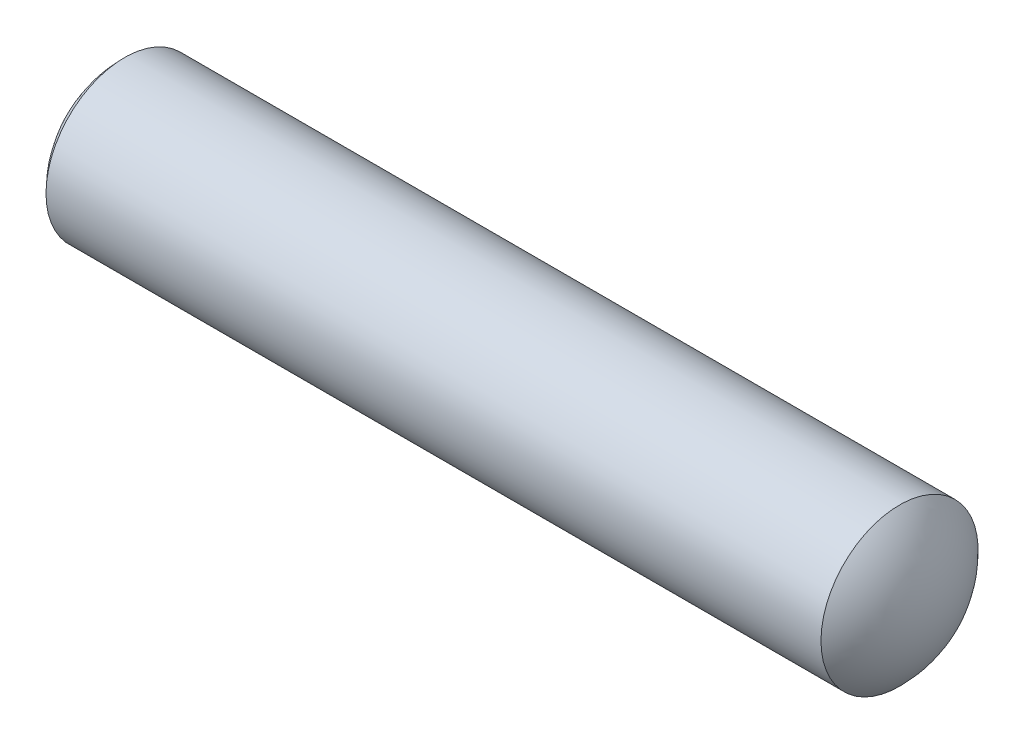
ISO-10303-21;
HEADER;
FILE_DESCRIPTION(('STEP AP214'),'2;1');
FILE_NAME('part.step','',(''),(''),'','','');
FILE_SCHEMA(('AUTOMOTIVE_DESIGN { 1 0 10303 214 1 1 1 1 }'));
ENDSEC;
DATA;
#1=APPLICATION_CONTEXT('core data for automotive mechanical design processes');
#2=APPLICATION_PROTOCOL_DEFINITION('international standard','automotive_design',2000,#1);
#3=PRODUCT_CONTEXT('',#1,'mechanical');
#4=PRODUCT('Part','Part','',(#3));
#5=PRODUCT_RELATED_PRODUCT_CATEGORY('part','',(#4));
#6=PRODUCT_DEFINITION_FORMATION('','',#4);
#7=PRODUCT_DEFINITION_CONTEXT('part definition',#1,'design');
#8=PRODUCT_DEFINITION('design','',#6,#7);
#9=PRODUCT_DEFINITION_SHAPE('','',#8);
#10=(LENGTH_UNIT() NAMED_UNIT(*) SI_UNIT(.MILLI.,.METRE.));
#11=(NAMED_UNIT(*) PLANE_ANGLE_UNIT() SI_UNIT($,.RADIAN.));
#12=(NAMED_UNIT(*) SI_UNIT($,.STERADIAN.) SOLID_ANGLE_UNIT());
#13=UNCERTAINTY_MEASURE_WITH_UNIT(LENGTH_MEASURE(1.E-05),#10,'distance_accuracy_value','');
#14=(GEOMETRIC_REPRESENTATION_CONTEXT(3) GLOBAL_UNCERTAINTY_ASSIGNED_CONTEXT((#13)) GLOBAL_UNIT_ASSIGNED_CONTEXT((#10,
#11,#12)) REPRESENTATION_CONTEXT('',''));
#15=CARTESIAN_POINT('',(0.,0.,0.));
#16=DIRECTION('',(0.,0.,1.));
#17=DIRECTION('',(1.,0.,0.));
#18=AXIS2_PLACEMENT_3D('',#15,#16,#17);
#19=CARTESIAN_POINT('',(15.1875,-20.449194000159,6.00442511768297));
#20=DIRECTION('',(0.,-0.281732556841429,-0.959492973614498));
#21=DIRECTION('',(1.,0.,0.));
#22=AXIS2_PLACEMENT_3D('',#19,#20,#21);
#23=SPHERICAL_SURFACE('',#22,1.8375);
#24=CARTESIAN_POINT('',(15.1875,-20.449194000159,6.00442511768297));
#25=DIRECTION('',(-1.,0.,0.));
#26=DIRECTION('',(0.,0.959492973614497,-0.28173255684143));
#27=AXIS2_PLACEMENT_3D('',#24,#25,#26);
#28=SPHERICAL_SURFACE('',#27,1.8375);
#29=CARTESIAN_POINT('',(16.4734821149612,-20.449194000159,6.00442511768297));
#30=DIRECTION('',(-1.,0.,0.));
#31=DIRECTION('',(0.,0.959492973614497,-0.28173255684143));
#32=AXIS2_PLACEMENT_3D('',#29,#30,#31);
#33=CIRCLE('',#32,1.3125);
#34=CARTESIAN_POINT('',(16.4734821149612,-19.18985947229,5.63465113682859));
#35=VERTEX_POINT('',#34);
#36=EDGE_CURVE('E11',#35,#35,#33,.T.);
#37=ORIENTED_EDGE('',*,*,#36,.F.);
#38=EDGE_LOOP('',(#37));
#39=FACE_BOUND('',#38,.T.);
#40=ADVANCED_FACE('F17',(#39),#28,.T.);
#41=CARTESIAN_POINT('',(10.,-20.449194000159,6.00442511768297));
#42=DIRECTION('',(-1.,0.,0.));
#43=DIRECTION('',(0.,0.959492973614497,-0.28173255684143));
#44=AXIS2_PLACEMENT_3D('',#41,#42,#43);
#45=CYLINDRICAL_SURFACE('',#44,1.3125);
#46=CARTESIAN_POINT('',(3.52651788503884,-20.449194000159,6.00442511768297));
#47=DIRECTION('',(-1.,0.,0.));
#48=DIRECTION('',(0.,0.959492973614497,-0.28173255684143));
#49=AXIS2_PLACEMENT_3D('',#46,#47,#48);
#50=CIRCLE('',#49,1.3125);
#51=CARTESIAN_POINT('',(3.52651788503884,-19.18985947229,5.63465113682859));
#52=VERTEX_POINT('',#51);
#53=EDGE_CURVE('E26',#52,#52,#50,.T.);
#54=ORIENTED_EDGE('',*,*,#53,.F.);
#55=EDGE_LOOP('',(#54));
#56=FACE_BOUND('',#55,.T.);
#57=ORIENTED_EDGE('',*,*,#36,.T.);
#58=EDGE_LOOP('',(#57));
#59=FACE_BOUND('',#58,.T.);
#60=ADVANCED_FACE('F19',(#56,#59),#45,.T.);
#61=CARTESIAN_POINT('',(4.8125,-20.449194000159,6.00442511768297));
#62=DIRECTION('',(0.,-0.281732556841429,-0.959492973614498));
#63=DIRECTION('',(-1.,0.,0.));
#64=AXIS2_PLACEMENT_3D('',#61,#62,#63);
#65=SPHERICAL_SURFACE('',#64,1.8375);
#66=CARTESIAN_POINT('',(4.8125,-20.449194000159,6.00442511768297));
#67=DIRECTION('',(-1.,0.,0.));
#68=DIRECTION('',(0.,0.959492973614497,-0.28173255684143));
#69=AXIS2_PLACEMENT_3D('',#66,#67,#68);
#70=SPHERICAL_SURFACE('',#69,1.8375);
#71=ORIENTED_EDGE('',*,*,#53,.T.);
#72=EDGE_LOOP('',(#71));
#73=FACE_BOUND('',#72,.T.);
#74=ADVANCED_FACE('F40',(#73),#70,.T.);
#75=CLOSED_SHELL('',(#40,#60,#74));
#76=MANIFOLD_SOLID_BREP('B1',#75);
#77=ADVANCED_BREP_SHAPE_REPRESENTATION('',(#18,#76),#14);
#78=SHAPE_DEFINITION_REPRESENTATION(#9,#77);
ENDSEC;
END-ISO-10303-21;
